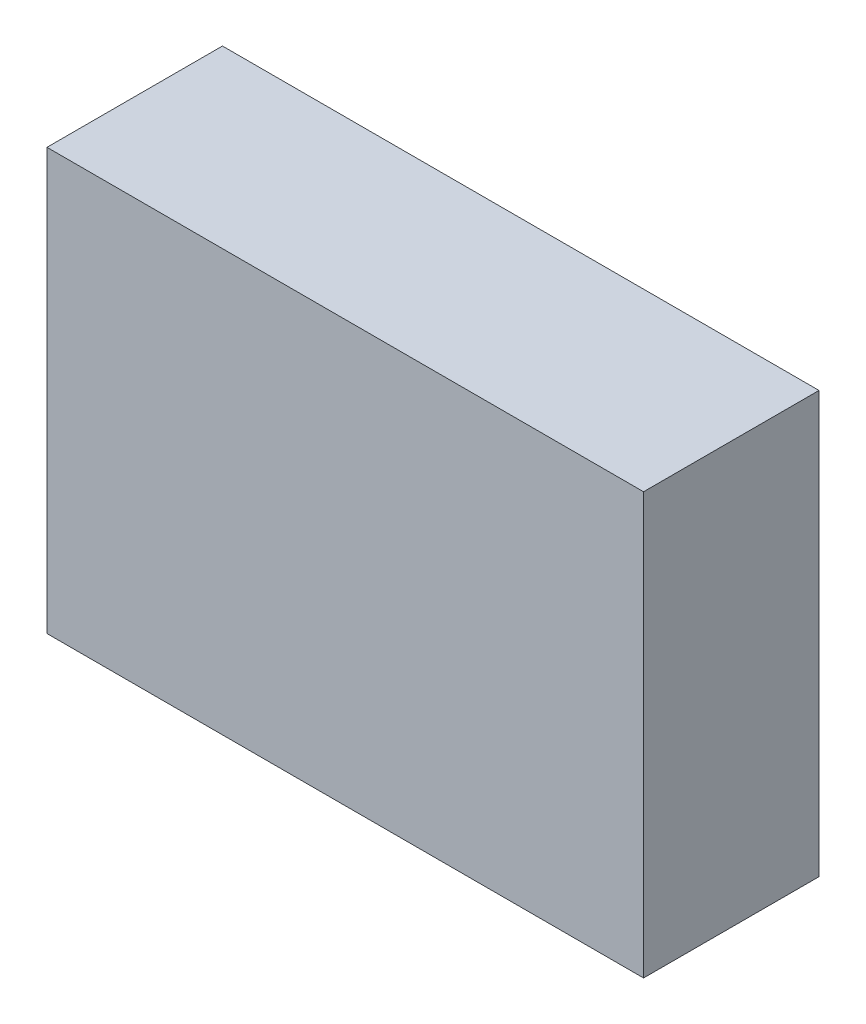
ISO-10303-21;
HEADER;
FILE_DESCRIPTION(('STEP AP214'),'2;1');
FILE_NAME('part.step','',(''),(''),'','','');
FILE_SCHEMA(('AUTOMOTIVE_DESIGN { 1 0 10303 214 1 1 1 1 }'));
ENDSEC;
DATA;
#1=APPLICATION_CONTEXT('core data for automotive mechanical design processes');
#2=APPLICATION_PROTOCOL_DEFINITION('international standard','automotive_design',2000,#1);
#3=PRODUCT_CONTEXT('',#1,'mechanical');
#4=PRODUCT('Part','Part','',(#3));
#5=PRODUCT_RELATED_PRODUCT_CATEGORY('part','',(#4));
#6=PRODUCT_DEFINITION_FORMATION('','',#4);
#7=PRODUCT_DEFINITION_CONTEXT('part definition',#1,'design');
#8=PRODUCT_DEFINITION('design','',#6,#7);
#9=PRODUCT_DEFINITION_SHAPE('','',#8);
#10=(LENGTH_UNIT() NAMED_UNIT(*) SI_UNIT(.MILLI.,.METRE.));
#11=(NAMED_UNIT(*) PLANE_ANGLE_UNIT() SI_UNIT($,.RADIAN.));
#12=(NAMED_UNIT(*) SI_UNIT($,.STERADIAN.) SOLID_ANGLE_UNIT());
#13=UNCERTAINTY_MEASURE_WITH_UNIT(LENGTH_MEASURE(1.E-05),#10,'distance_accuracy_value','');
#14=(GEOMETRIC_REPRESENTATION_CONTEXT(3) GLOBAL_UNCERTAINTY_ASSIGNED_CONTEXT((#13)) GLOBAL_UNIT_ASSIGNED_CONTEXT((#10,
#11,#12)) REPRESENTATION_CONTEXT('',''));
#15=CARTESIAN_POINT('',(0.,0.,0.));
#16=DIRECTION('',(0.,0.,1.));
#17=DIRECTION('',(1.,0.,0.));
#18=AXIS2_PLACEMENT_3D('',#15,#16,#17);
#19=CARTESIAN_POINT('',(-2.92,-2.37,0.));
#20=DIRECTION('',(1.,0.,0.));
#21=DIRECTION('',(0.,0.,1.));
#22=AXIS2_PLACEMENT_3D('',#19,#20,#21);
#23=PLANE('',#22);
#24=DIRECTION('',(0.,1.,0.));
#25=VECTOR('',#24,1.);
#26=CARTESIAN_POINT('',(-2.92,-2.37,0.1));
#27=LINE('',#26,#25);
#28=CARTESIAN_POINT('',(-2.92,-2.37,0.1));
#29=VERTEX_POINT('',#28);
#30=CARTESIAN_POINT('',(-2.92,-2.13,0.1));
#31=VERTEX_POINT('',#30);
#32=EDGE_CURVE('E11',#29,#31,#27,.T.);
#33=ORIENTED_EDGE('',*,*,#32,.T.);
#34=DIRECTION('',(0.,0.,1.));
#35=VECTOR('',#34,1.);
#36=CARTESIAN_POINT('',(-2.92,-2.13,0.));
#37=LINE('',#36,#35);
#38=CARTESIAN_POINT('',(-2.92,-2.13,0.));
#39=VERTEX_POINT('',#38);
#40=EDGE_CURVE('E24',#39,#31,#37,.T.);
#41=ORIENTED_EDGE('',*,*,#40,.F.);
#42=DIRECTION('',(0.,1.,0.));
#43=VECTOR('',#42,1.);
#44=CARTESIAN_POINT('',(-2.92,-2.37,0.));
#45=LINE('',#44,#43);
#46=CARTESIAN_POINT('',(-2.92,-2.37,0.));
#47=VERTEX_POINT('',#46);
#48=EDGE_CURVE('E86',#47,#39,#45,.T.);
#49=ORIENTED_EDGE('',*,*,#48,.F.);
#50=DIRECTION('',(0.,0.,1.));
#51=VECTOR('',#50,1.);
#52=CARTESIAN_POINT('',(-2.92,-2.37,0.));
#53=LINE('',#52,#51);
#54=EDGE_CURVE('E36',#47,#29,#53,.T.);
#55=ORIENTED_EDGE('',*,*,#54,.T.);
#56=EDGE_LOOP('',(#33,#41,#49,#55));
#57=FACE_BOUND('',#56,.T.);
#58=ADVANCED_FACE('F17',(#57),#23,.F.);
#59=CARTESIAN_POINT('',(-2.58,-2.37,0.));
#60=DIRECTION('',(1.,0.,0.));
#61=DIRECTION('',(0.,0.,1.));
#62=AXIS2_PLACEMENT_3D('',#59,#60,#61);
#63=PLANE('',#62);
#64=DIRECTION('',(0.,0.,1.));
#65=VECTOR('',#64,1.);
#66=CARTESIAN_POINT('',(-2.58,-2.37,0.));
#67=LINE('',#66,#65);
#68=CARTESIAN_POINT('',(-2.58,-2.37,0.));
#69=VERTEX_POINT('',#68);
#70=CARTESIAN_POINT('',(-2.58,-2.37,0.1));
#71=VERTEX_POINT('',#70);
#72=EDGE_CURVE('E83',#69,#71,#67,.T.);
#73=ORIENTED_EDGE('',*,*,#72,.F.);
#74=DIRECTION('',(0.,1.,0.));
#75=VECTOR('',#74,1.);
#76=CARTESIAN_POINT('',(-2.58,-2.37,0.));
#77=LINE('',#76,#75);
#78=CARTESIAN_POINT('',(-2.58,-2.13,0.));
#79=VERTEX_POINT('',#78);
#80=EDGE_CURVE('E63',#69,#79,#77,.T.);
#81=ORIENTED_EDGE('',*,*,#80,.T.);
#82=DIRECTION('',(0.,0.,1.));
#83=VECTOR('',#82,1.);
#84=CARTESIAN_POINT('',(-2.58,-2.13,0.));
#85=LINE('',#84,#83);
#86=CARTESIAN_POINT('',(-2.58,-2.13,0.1));
#87=VERTEX_POINT('',#86);
#88=EDGE_CURVE('E57',#79,#87,#85,.T.);
#89=ORIENTED_EDGE('',*,*,#88,.T.);
#90=DIRECTION('',(0.,1.,0.));
#91=VECTOR('',#90,1.);
#92=CARTESIAN_POINT('',(-2.58,-2.37,0.1));
#93=LINE('',#92,#91);
#94=EDGE_CURVE('E60',#71,#87,#93,.T.);
#95=ORIENTED_EDGE('',*,*,#94,.F.);
#96=EDGE_LOOP('',(#73,#81,#89,#95));
#97=FACE_BOUND('',#96,.T.);
#98=ADVANCED_FACE('F59',(#97),#63,.T.);
#99=CARTESIAN_POINT('',(-2.92,-2.37,0.));
#100=DIRECTION('',(0.,1.,0.));
#101=DIRECTION('',(0.,0.,1.));
#102=AXIS2_PLACEMENT_3D('',#99,#100,#101);
#103=PLANE('',#102);
#104=ORIENTED_EDGE('',*,*,#72,.T.);
#105=DIRECTION('',(1.,0.,0.));
#106=VECTOR('',#105,1.);
#107=CARTESIAN_POINT('',(-2.92,-2.37,0.1));
#108=LINE('',#107,#106);
#109=EDGE_CURVE('E71',#29,#71,#108,.T.);
#110=ORIENTED_EDGE('',*,*,#109,.F.);
#111=ORIENTED_EDGE('',*,*,#54,.F.);
#112=DIRECTION('',(1.,0.,0.));
#113=VECTOR('',#112,1.);
#114=CARTESIAN_POINT('',(-2.92,-2.37,0.));
#115=LINE('',#114,#113);
#116=EDGE_CURVE('E76',#47,#69,#115,.T.);
#117=ORIENTED_EDGE('',*,*,#116,.T.);
#118=EDGE_LOOP('',(#104,#110,#111,#117));
#119=FACE_BOUND('',#118,.T.);
#120=ADVANCED_FACE('F91',(#119),#103,.F.);
#121=CARTESIAN_POINT('',(-2.92,-2.13,0.));
#122=DIRECTION('',(0.,1.,0.));
#123=DIRECTION('',(0.,0.,1.));
#124=AXIS2_PLACEMENT_3D('',#121,#122,#123);
#125=PLANE('',#124);
#126=DIRECTION('',(1.,0.,0.));
#127=VECTOR('',#126,1.);
#128=CARTESIAN_POINT('',(-2.92,-2.13,0.));
#129=LINE('',#128,#127);
#130=EDGE_CURVE('E74',#39,#79,#129,.T.);
#131=ORIENTED_EDGE('',*,*,#130,.F.);
#132=ORIENTED_EDGE('',*,*,#40,.T.);
#133=DIRECTION('',(1.,0.,0.));
#134=VECTOR('',#133,1.);
#135=CARTESIAN_POINT('',(-2.92,-2.13,0.1));
#136=LINE('',#135,#134);
#137=EDGE_CURVE('E69',#31,#87,#136,.T.);
#138=ORIENTED_EDGE('',*,*,#137,.T.);
#139=ORIENTED_EDGE('',*,*,#88,.F.);
#140=EDGE_LOOP('',(#131,#132,#138,#139));
#141=FACE_BOUND('',#140,.T.);
#142=ADVANCED_FACE('F73',(#141),#125,.T.);
#143=CARTESIAN_POINT('',(-2.92,-2.37,0.));
#144=DIRECTION('',(0.,0.,1.));
#145=DIRECTION('',(1.,0.,0.));
#146=AXIS2_PLACEMENT_3D('',#143,#144,#145);
#147=PLANE('',#146);
#148=ORIENTED_EDGE('',*,*,#130,.T.);
#149=ORIENTED_EDGE('',*,*,#80,.F.);
#150=ORIENTED_EDGE('',*,*,#116,.F.);
#151=ORIENTED_EDGE('',*,*,#48,.T.);
#152=EDGE_LOOP('',(#148,#149,#150,#151));
#153=FACE_BOUND('',#152,.T.);
#154=ADVANCED_FACE('F89',(#153),#147,.F.);
#155=CARTESIAN_POINT('',(-2.92,-2.37,0.1));
#156=DIRECTION('',(0.,0.,1.));
#157=DIRECTION('',(1.,0.,0.));
#158=AXIS2_PLACEMENT_3D('',#155,#156,#157);
#159=PLANE('',#158);
#160=ORIENTED_EDGE('',*,*,#32,.F.);
#161=ORIENTED_EDGE('',*,*,#109,.T.);
#162=ORIENTED_EDGE('',*,*,#94,.T.);
#163=ORIENTED_EDGE('',*,*,#137,.F.);
#164=EDGE_LOOP('',(#160,#161,#162,#163));
#165=FACE_BOUND('',#164,.T.);
#166=ADVANCED_FACE('F68',(#165),#159,.T.);
#167=CLOSED_SHELL('',(#58,#98,#120,#142,#154,#166));
#168=MANIFOLD_SOLID_BREP('B1',#167);
#169=ADVANCED_BREP_SHAPE_REPRESENTATION('',(#18,#168),#14);
#170=SHAPE_DEFINITION_REPRESENTATION(#9,#169);
ENDSEC;
END-ISO-10303-21;
